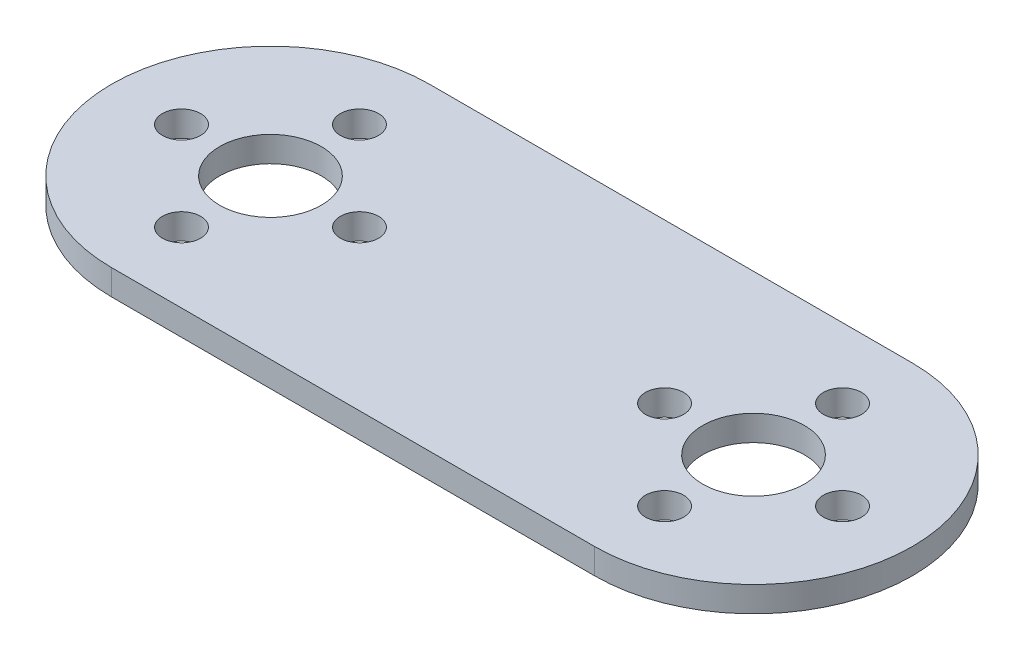
ISO-10303-21;
HEADER;
FILE_DESCRIPTION(('STEP AP214'),'2;1');
FILE_NAME('part.step','',(''),(''),'','','');
FILE_SCHEMA(('AUTOMOTIVE_DESIGN { 1 0 10303 214 1 1 1 1 }'));
ENDSEC;
DATA;
#1=APPLICATION_CONTEXT('core data for automotive mechanical design processes');
#2=APPLICATION_PROTOCOL_DEFINITION('international standard','automotive_design',2000,#1);
#3=PRODUCT_CONTEXT('',#1,'mechanical');
#4=PRODUCT('Part','Part','',(#3));
#5=PRODUCT_RELATED_PRODUCT_CATEGORY('part','',(#4));
#6=PRODUCT_DEFINITION_FORMATION('','',#4);
#7=PRODUCT_DEFINITION_CONTEXT('part definition',#1,'design');
#8=PRODUCT_DEFINITION('design','',#6,#7);
#9=PRODUCT_DEFINITION_SHAPE('','',#8);
#10=(LENGTH_UNIT() NAMED_UNIT(*) SI_UNIT(.MILLI.,.METRE.));
#11=(NAMED_UNIT(*) PLANE_ANGLE_UNIT() SI_UNIT($,.RADIAN.));
#12=(NAMED_UNIT(*) SI_UNIT($,.STERADIAN.) SOLID_ANGLE_UNIT());
#13=UNCERTAINTY_MEASURE_WITH_UNIT(LENGTH_MEASURE(1.E-05),#10,'distance_accuracy_value','');
#14=(GEOMETRIC_REPRESENTATION_CONTEXT(3) GLOBAL_UNCERTAINTY_ASSIGNED_CONTEXT((#13)) GLOBAL_UNIT_ASSIGNED_CONTEXT((#10,
#11,#12)) REPRESENTATION_CONTEXT('',''));
#15=CARTESIAN_POINT('',(0.,0.,0.));
#16=DIRECTION('',(0.,0.,1.));
#17=DIRECTION('',(1.,0.,0.));
#18=AXIS2_PLACEMENT_3D('',#15,#16,#17);
#19=CARTESIAN_POINT('',(-19.,2.,0.));
#20=DIRECTION('',(0.,1.,0.));
#21=DIRECTION('',(0.,0.,1.));
#22=AXIS2_PLACEMENT_3D('',#19,#20,#21);
#23=PLANE('',#22);
#24=CARTESIAN_POINT('',(26.,2.,0.));
#25=DIRECTION('',(0.,1.,0.));
#26=DIRECTION('',(0.,0.,1.));
#27=AXIS2_PLACEMENT_3D('',#24,#25,#26);
#28=CIRCLE('',#27,1.5);
#29=CARTESIAN_POINT('',(26.,2.,1.5));
#30=VERTEX_POINT('',#29);
#31=EDGE_CURVE('E157',#30,#30,#28,.T.);
#32=ORIENTED_EDGE('',*,*,#31,.F.);
#33=EDGE_LOOP('',(#32));
#34=FACE_BOUND('',#33,.T.);
#35=CARTESIAN_POINT('',(12.,2.,0.));
#36=DIRECTION('',(0.,1.,0.));
#37=DIRECTION('',(0.,0.,1.));
#38=AXIS2_PLACEMENT_3D('',#35,#36,#37);
#39=CIRCLE('',#38,1.5);
#40=CARTESIAN_POINT('',(12.,2.,1.5));
#41=VERTEX_POINT('',#40);
#42=EDGE_CURVE('E145',#41,#41,#39,.T.);
#43=ORIENTED_EDGE('',*,*,#42,.F.);
#44=EDGE_LOOP('',(#43));
#45=FACE_BOUND('',#44,.T.);
#46=CARTESIAN_POINT('',(-26.,2.,0.));
#47=DIRECTION('',(0.,1.,0.));
#48=DIRECTION('',(0.,0.,1.));
#49=AXIS2_PLACEMENT_3D('',#46,#47,#48);
#50=CIRCLE('',#49,1.5);
#51=CARTESIAN_POINT('',(-26.,2.,1.5));
#52=VERTEX_POINT('',#51);
#53=EDGE_CURVE('E133',#52,#52,#50,.T.);
#54=ORIENTED_EDGE('',*,*,#53,.F.);
#55=EDGE_LOOP('',(#54));
#56=FACE_BOUND('',#55,.T.);
#57=CARTESIAN_POINT('',(-19.,2.,-7.));
#58=DIRECTION('',(0.,1.,0.));
#59=DIRECTION('',(0.,0.,1.));
#60=AXIS2_PLACEMENT_3D('',#57,#58,#59);
#61=CIRCLE('',#60,1.5);
#62=CARTESIAN_POINT('',(-19.,2.,-5.5));
#63=VERTEX_POINT('',#62);
#64=EDGE_CURVE('E121',#63,#63,#61,.T.);
#65=ORIENTED_EDGE('',*,*,#64,.F.);
#66=EDGE_LOOP('',(#65));
#67=FACE_BOUND('',#66,.T.);
#68=CARTESIAN_POINT('',(-19.,2.,0.));
#69=DIRECTION('',(0.,1.,0.));
#70=DIRECTION('',(0.,0.,1.));
#71=AXIS2_PLACEMENT_3D('',#68,#69,#70);
#72=CIRCLE('',#71,4.);
#73=CARTESIAN_POINT('',(-19.,2.,4.));
#74=VERTEX_POINT('',#73);
#75=EDGE_CURVE('E100',#74,#74,#72,.T.);
#76=ORIENTED_EDGE('',*,*,#75,.F.);
#77=EDGE_LOOP('',(#76));
#78=FACE_BOUND('',#77,.T.);
#79=CARTESIAN_POINT('',(-19.,2.,0.));
#80=DIRECTION('',(0.,1.,0.));
#81=DIRECTION('',(0.,0.,1.));
#82=AXIS2_PLACEMENT_3D('',#79,#80,#81);
#83=CIRCLE('',#82,12.5);
#84=CARTESIAN_POINT('',(-19.,2.,-12.5));
#85=VERTEX_POINT('',#84);
#86=CARTESIAN_POINT('',(-19.,2.,12.5));
#87=VERTEX_POINT('',#86);
#88=EDGE_CURVE('E85',#85,#87,#83,.T.);
#89=ORIENTED_EDGE('',*,*,#88,.T.);
#90=DIRECTION('',(1.,0.,0.));
#91=VECTOR('',#90,1.);
#92=CARTESIAN_POINT('',(19.,2.,12.5));
#93=LINE('',#92,#91);
#94=CARTESIAN_POINT('',(19.,2.,12.5));
#95=VERTEX_POINT('',#94);
#96=EDGE_CURVE('E80',#87,#95,#93,.T.);
#97=ORIENTED_EDGE('',*,*,#96,.T.);
#98=CARTESIAN_POINT('',(19.,2.,0.));
#99=DIRECTION('',(0.,1.,0.));
#100=DIRECTION('',(0.,0.,-1.));
#101=AXIS2_PLACEMENT_3D('',#98,#99,#100);
#102=CIRCLE('',#101,12.5);
#103=CARTESIAN_POINT('',(19.,2.,-12.5));
#104=VERTEX_POINT('',#103);
#105=EDGE_CURVE('E83',#95,#104,#102,.T.);
#106=ORIENTED_EDGE('',*,*,#105,.T.);
#107=DIRECTION('',(-1.,0.,0.));
#108=VECTOR('',#107,1.);
#109=CARTESIAN_POINT('',(19.,2.,-12.5));
#110=LINE('',#109,#108);
#111=EDGE_CURVE('E50',#104,#85,#110,.T.);
#112=ORIENTED_EDGE('',*,*,#111,.T.);
#113=EDGE_LOOP('',(#89,#97,#106,#112));
#114=FACE_BOUND('',#113,.T.);
#115=CARTESIAN_POINT('',(19.,2.,0.));
#116=DIRECTION('',(0.,1.,0.));
#117=DIRECTION('',(0.,0.,1.));
#118=AXIS2_PLACEMENT_3D('',#115,#116,#117);
#119=CIRCLE('',#118,4.);
#120=CARTESIAN_POINT('',(19.,2.,4.));
#121=VERTEX_POINT('',#120);
#122=EDGE_CURVE('E115',#121,#121,#119,.T.);
#123=ORIENTED_EDGE('',*,*,#122,.F.);
#124=EDGE_LOOP('',(#123));
#125=FACE_BOUND('',#124,.T.);
#126=CARTESIAN_POINT('',(-12.,2.,0.));
#127=DIRECTION('',(0.,1.,0.));
#128=DIRECTION('',(0.,0.,1.));
#129=AXIS2_PLACEMENT_3D('',#126,#127,#128);
#130=CIRCLE('',#129,1.5);
#131=CARTESIAN_POINT('',(-12.,2.,1.5));
#132=VERTEX_POINT('',#131);
#133=EDGE_CURVE('E127',#132,#132,#130,.T.);
#134=ORIENTED_EDGE('',*,*,#133,.F.);
#135=EDGE_LOOP('',(#134));
#136=FACE_BOUND('',#135,.T.);
#137=CARTESIAN_POINT('',(-19.,2.,7.));
#138=DIRECTION('',(0.,1.,0.));
#139=DIRECTION('',(0.,0.,1.));
#140=AXIS2_PLACEMENT_3D('',#137,#138,#139);
#141=CIRCLE('',#140,1.5);
#142=CARTESIAN_POINT('',(-19.,2.,8.5));
#143=VERTEX_POINT('',#142);
#144=EDGE_CURVE('E139',#143,#143,#141,.T.);
#145=ORIENTED_EDGE('',*,*,#144,.F.);
#146=EDGE_LOOP('',(#145));
#147=FACE_BOUND('',#146,.T.);
#148=CARTESIAN_POINT('',(19.,2.,-7.));
#149=DIRECTION('',(0.,1.,0.));
#150=DIRECTION('',(0.,0.,1.));
#151=AXIS2_PLACEMENT_3D('',#148,#149,#150);
#152=CIRCLE('',#151,1.5);
#153=CARTESIAN_POINT('',(19.,2.,-5.5));
#154=VERTEX_POINT('',#153);
#155=EDGE_CURVE('E151',#154,#154,#152,.T.);
#156=ORIENTED_EDGE('',*,*,#155,.F.);
#157=EDGE_LOOP('',(#156));
#158=FACE_BOUND('',#157,.T.);
#159=CARTESIAN_POINT('',(19.,2.,7.));
#160=DIRECTION('',(0.,1.,0.));
#161=DIRECTION('',(0.,0.,1.));
#162=AXIS2_PLACEMENT_3D('',#159,#160,#161);
#163=CIRCLE('',#162,1.5);
#164=CARTESIAN_POINT('',(19.,2.,8.5));
#165=VERTEX_POINT('',#164);
#166=EDGE_CURVE('E163',#165,#165,#163,.T.);
#167=ORIENTED_EDGE('',*,*,#166,.F.);
#168=EDGE_LOOP('',(#167));
#169=FACE_BOUND('',#168,.T.);
#170=ADVANCED_FACE('F33',(#34,#45,#56,#67,#78,#114,#125,#136,#147,#158,#169),#23,.T.);
#171=CARTESIAN_POINT('',(-19.,0.,0.));
#172=DIRECTION('',(0.,1.,0.));
#173=DIRECTION('',(0.,0.,1.));
#174=AXIS2_PLACEMENT_3D('',#171,#172,#173);
#175=PLANE('',#174);
#176=CARTESIAN_POINT('',(26.,0.,0.));
#177=DIRECTION('',(0.,1.,0.));
#178=DIRECTION('',(0.,0.,1.));
#179=AXIS2_PLACEMENT_3D('',#176,#177,#178);
#180=CIRCLE('',#179,1.5);
#181=CARTESIAN_POINT('',(26.,0.,1.5));
#182=VERTEX_POINT('',#181);
#183=EDGE_CURVE('E160',#182,#182,#180,.T.);
#184=ORIENTED_EDGE('',*,*,#183,.T.);
#185=EDGE_LOOP('',(#184));
#186=FACE_BOUND('',#185,.T.);
#187=CARTESIAN_POINT('',(12.,0.,0.));
#188=DIRECTION('',(0.,1.,0.));
#189=DIRECTION('',(0.,0.,1.));
#190=AXIS2_PLACEMENT_3D('',#187,#188,#189);
#191=CIRCLE('',#190,1.5);
#192=CARTESIAN_POINT('',(12.,0.,1.5));
#193=VERTEX_POINT('',#192);
#194=EDGE_CURVE('E148',#193,#193,#191,.T.);
#195=ORIENTED_EDGE('',*,*,#194,.T.);
#196=EDGE_LOOP('',(#195));
#197=FACE_BOUND('',#196,.T.);
#198=CARTESIAN_POINT('',(-26.,0.,0.));
#199=DIRECTION('',(0.,1.,0.));
#200=DIRECTION('',(0.,0.,1.));
#201=AXIS2_PLACEMENT_3D('',#198,#199,#200);
#202=CIRCLE('',#201,1.5);
#203=CARTESIAN_POINT('',(-26.,0.,1.5));
#204=VERTEX_POINT('',#203);
#205=EDGE_CURVE('E136',#204,#204,#202,.T.);
#206=ORIENTED_EDGE('',*,*,#205,.T.);
#207=EDGE_LOOP('',(#206));
#208=FACE_BOUND('',#207,.T.);
#209=CARTESIAN_POINT('',(-19.,0.,-7.));
#210=DIRECTION('',(0.,1.,0.));
#211=DIRECTION('',(0.,0.,1.));
#212=AXIS2_PLACEMENT_3D('',#209,#210,#211);
#213=CIRCLE('',#212,1.5);
#214=CARTESIAN_POINT('',(-19.,0.,-5.5));
#215=VERTEX_POINT('',#214);
#216=EDGE_CURVE('E124',#215,#215,#213,.T.);
#217=ORIENTED_EDGE('',*,*,#216,.T.);
#218=EDGE_LOOP('',(#217));
#219=FACE_BOUND('',#218,.T.);
#220=CARTESIAN_POINT('',(-19.,0.,0.));
#221=DIRECTION('',(0.,1.,0.));
#222=DIRECTION('',(0.,0.,1.));
#223=AXIS2_PLACEMENT_3D('',#220,#221,#222);
#224=CIRCLE('',#223,4.);
#225=CARTESIAN_POINT('',(-19.,0.,4.));
#226=VERTEX_POINT('',#225);
#227=EDGE_CURVE('E112',#226,#226,#224,.T.);
#228=ORIENTED_EDGE('',*,*,#227,.T.);
#229=EDGE_LOOP('',(#228));
#230=FACE_BOUND('',#229,.T.);
#231=CARTESIAN_POINT('',(-19.,0.,0.));
#232=DIRECTION('',(0.,1.,0.));
#233=DIRECTION('',(0.,0.,1.));
#234=AXIS2_PLACEMENT_3D('',#231,#232,#233);
#235=CIRCLE('',#234,12.5);
#236=CARTESIAN_POINT('',(-19.,0.,-12.5));
#237=VERTEX_POINT('',#236);
#238=CARTESIAN_POINT('',(-19.,0.,12.5));
#239=VERTEX_POINT('',#238);
#240=EDGE_CURVE('E97',#237,#239,#235,.T.);
#241=ORIENTED_EDGE('',*,*,#240,.F.);
#242=DIRECTION('',(-1.,0.,0.));
#243=VECTOR('',#242,1.);
#244=CARTESIAN_POINT('',(19.,0.,-12.5));
#245=LINE('',#244,#243);
#246=CARTESIAN_POINT('',(19.,0.,-12.5));
#247=VERTEX_POINT('',#246);
#248=EDGE_CURVE('E73',#247,#237,#245,.T.);
#249=ORIENTED_EDGE('',*,*,#248,.F.);
#250=CARTESIAN_POINT('',(19.,0.,0.));
#251=DIRECTION('',(0.,1.,0.));
#252=DIRECTION('',(0.,0.,-1.));
#253=AXIS2_PLACEMENT_3D('',#250,#251,#252);
#254=CIRCLE('',#253,12.5);
#255=CARTESIAN_POINT('',(19.,0.,12.5));
#256=VERTEX_POINT('',#255);
#257=EDGE_CURVE('E67',#256,#247,#254,.T.);
#258=ORIENTED_EDGE('',*,*,#257,.F.);
#259=DIRECTION('',(1.,0.,0.));
#260=VECTOR('',#259,1.);
#261=CARTESIAN_POINT('',(19.,0.,12.5));
#262=LINE('',#261,#260);
#263=EDGE_CURVE('E89',#239,#256,#262,.T.);
#264=ORIENTED_EDGE('',*,*,#263,.F.);
#265=EDGE_LOOP('',(#241,#249,#258,#264));
#266=FACE_BOUND('',#265,.T.);
#267=CARTESIAN_POINT('',(19.,0.,0.));
#268=DIRECTION('',(0.,1.,0.));
#269=DIRECTION('',(0.,0.,1.));
#270=AXIS2_PLACEMENT_3D('',#267,#268,#269);
#271=CIRCLE('',#270,4.);
#272=CARTESIAN_POINT('',(19.,0.,4.));
#273=VERTEX_POINT('',#272);
#274=EDGE_CURVE('E118',#273,#273,#271,.T.);
#275=ORIENTED_EDGE('',*,*,#274,.T.);
#276=EDGE_LOOP('',(#275));
#277=FACE_BOUND('',#276,.T.);
#278=CARTESIAN_POINT('',(-12.,0.,0.));
#279=DIRECTION('',(0.,1.,0.));
#280=DIRECTION('',(0.,0.,1.));
#281=AXIS2_PLACEMENT_3D('',#278,#279,#280);
#282=CIRCLE('',#281,1.5);
#283=CARTESIAN_POINT('',(-12.,0.,1.5));
#284=VERTEX_POINT('',#283);
#285=EDGE_CURVE('E130',#284,#284,#282,.T.);
#286=ORIENTED_EDGE('',*,*,#285,.T.);
#287=EDGE_LOOP('',(#286));
#288=FACE_BOUND('',#287,.T.);
#289=CARTESIAN_POINT('',(-19.,0.,7.));
#290=DIRECTION('',(0.,1.,0.));
#291=DIRECTION('',(0.,0.,1.));
#292=AXIS2_PLACEMENT_3D('',#289,#290,#291);
#293=CIRCLE('',#292,1.5);
#294=CARTESIAN_POINT('',(-19.,0.,8.5));
#295=VERTEX_POINT('',#294);
#296=EDGE_CURVE('E142',#295,#295,#293,.T.);
#297=ORIENTED_EDGE('',*,*,#296,.T.);
#298=EDGE_LOOP('',(#297));
#299=FACE_BOUND('',#298,.T.);
#300=CARTESIAN_POINT('',(19.,0.,-7.));
#301=DIRECTION('',(0.,1.,0.));
#302=DIRECTION('',(0.,0.,1.));
#303=AXIS2_PLACEMENT_3D('',#300,#301,#302);
#304=CIRCLE('',#303,1.5);
#305=CARTESIAN_POINT('',(19.,0.,-5.5));
#306=VERTEX_POINT('',#305);
#307=EDGE_CURVE('E154',#306,#306,#304,.T.);
#308=ORIENTED_EDGE('',*,*,#307,.T.);
#309=EDGE_LOOP('',(#308));
#310=FACE_BOUND('',#309,.T.);
#311=CARTESIAN_POINT('',(19.,0.,7.));
#312=DIRECTION('',(0.,1.,0.));
#313=DIRECTION('',(0.,0.,1.));
#314=AXIS2_PLACEMENT_3D('',#311,#312,#313);
#315=CIRCLE('',#314,1.5);
#316=CARTESIAN_POINT('',(19.,0.,8.5));
#317=VERTEX_POINT('',#316);
#318=EDGE_CURVE('E166',#317,#317,#315,.T.);
#319=ORIENTED_EDGE('',*,*,#318,.T.);
#320=EDGE_LOOP('',(#319));
#321=FACE_BOUND('',#320,.T.);
#322=ADVANCED_FACE('F108',(#186,#197,#208,#219,#230,#266,#277,#288,#299,#310,#321),#175,.F.);
#323=CARTESIAN_POINT('',(-19.,2.,0.));
#324=DIRECTION('',(0.,-1.,0.));
#325=DIRECTION('',(0.,0.,-1.));
#326=AXIS2_PLACEMENT_3D('',#323,#324,#325);
#327=CYLINDRICAL_SURFACE('',#326,12.5);
#328=ORIENTED_EDGE('',*,*,#240,.T.);
#329=DIRECTION('',(0.,-1.,0.));
#330=VECTOR('',#329,1.);
#331=CARTESIAN_POINT('',(-19.,2.,12.5));
#332=LINE('',#331,#330);
#333=EDGE_CURVE('E11',#87,#239,#332,.T.);
#334=ORIENTED_EDGE('',*,*,#333,.F.);
#335=ORIENTED_EDGE('',*,*,#88,.F.);
#336=DIRECTION('',(0.,-1.,0.));
#337=VECTOR('',#336,1.);
#338=CARTESIAN_POINT('',(-19.,2.,-12.5));
#339=LINE('',#338,#337);
#340=EDGE_CURVE('E93',#85,#237,#339,.T.);
#341=ORIENTED_EDGE('',*,*,#340,.T.);
#342=EDGE_LOOP('',(#328,#334,#335,#341));
#343=FACE_BOUND('',#342,.T.);
#344=ADVANCED_FACE('F35',(#343),#327,.T.);
#345=CARTESIAN_POINT('',(19.,2.,12.5));
#346=DIRECTION('',(0.,0.,-1.));
#347=DIRECTION('',(-1.,0.,0.));
#348=AXIS2_PLACEMENT_3D('',#345,#346,#347);
#349=PLANE('',#348);
#350=ORIENTED_EDGE('',*,*,#263,.T.);
#351=DIRECTION('',(0.,-1.,0.));
#352=VECTOR('',#351,1.);
#353=CARTESIAN_POINT('',(19.,2.,12.5));
#354=LINE('',#353,#352);
#355=EDGE_CURVE('E42',#95,#256,#354,.T.);
#356=ORIENTED_EDGE('',*,*,#355,.F.);
#357=ORIENTED_EDGE('',*,*,#96,.F.);
#358=ORIENTED_EDGE('',*,*,#333,.T.);
#359=EDGE_LOOP('',(#350,#356,#357,#358));
#360=FACE_BOUND('',#359,.T.);
#361=ADVANCED_FACE('F88',(#360),#349,.F.);
#362=CARTESIAN_POINT('',(19.,2.,0.));
#363=DIRECTION('',(0.,-1.,0.));
#364=DIRECTION('',(0.,0.,-1.));
#365=AXIS2_PLACEMENT_3D('',#362,#363,#364);
#366=CYLINDRICAL_SURFACE('',#365,12.5);
#367=ORIENTED_EDGE('',*,*,#257,.T.);
#368=DIRECTION('',(0.,-1.,0.));
#369=VECTOR('',#368,1.);
#370=CARTESIAN_POINT('',(19.,2.,-12.5));
#371=LINE('',#370,#369);
#372=EDGE_CURVE('E90',#104,#247,#371,.T.);
#373=ORIENTED_EDGE('',*,*,#372,.F.);
#374=ORIENTED_EDGE('',*,*,#105,.F.);
#375=ORIENTED_EDGE('',*,*,#355,.T.);
#376=EDGE_LOOP('',(#367,#373,#374,#375));
#377=FACE_BOUND('',#376,.T.);
#378=ADVANCED_FACE('F91',(#377),#366,.T.);
#379=CARTESIAN_POINT('',(19.,2.,-12.5));
#380=DIRECTION('',(0.,0.,1.));
#381=DIRECTION('',(1.,0.,0.));
#382=AXIS2_PLACEMENT_3D('',#379,#380,#381);
#383=PLANE('',#382);
#384=ORIENTED_EDGE('',*,*,#248,.T.);
#385=ORIENTED_EDGE('',*,*,#340,.F.);
#386=ORIENTED_EDGE('',*,*,#111,.F.);
#387=ORIENTED_EDGE('',*,*,#372,.T.);
#388=EDGE_LOOP('',(#384,#385,#386,#387));
#389=FACE_BOUND('',#388,.T.);
#390=ADVANCED_FACE('F105',(#389),#383,.F.);
#391=CARTESIAN_POINT('',(-19.,2.,0.));
#392=DIRECTION('',(0.,-1.,0.));
#393=DIRECTION('',(0.,0.,-1.));
#394=AXIS2_PLACEMENT_3D('',#391,#392,#393);
#395=CYLINDRICAL_SURFACE('',#394,4.);
#396=ORIENTED_EDGE('',*,*,#75,.T.);
#397=EDGE_LOOP('',(#396));
#398=FACE_BOUND('',#397,.T.);
#399=ORIENTED_EDGE('',*,*,#227,.F.);
#400=EDGE_LOOP('',(#399));
#401=FACE_BOUND('',#400,.T.);
#402=ADVANCED_FACE('F186',(#398,#401),#395,.F.);
#403=CARTESIAN_POINT('',(19.,2.,0.));
#404=DIRECTION('',(0.,-1.,0.));
#405=DIRECTION('',(0.,0.,-1.));
#406=AXIS2_PLACEMENT_3D('',#403,#404,#405);
#407=CYLINDRICAL_SURFACE('',#406,4.);
#408=ORIENTED_EDGE('',*,*,#122,.T.);
#409=EDGE_LOOP('',(#408));
#410=FACE_BOUND('',#409,.T.);
#411=ORIENTED_EDGE('',*,*,#274,.F.);
#412=EDGE_LOOP('',(#411));
#413=FACE_BOUND('',#412,.T.);
#414=ADVANCED_FACE('F232',(#410,#413),#407,.F.);
#415=CARTESIAN_POINT('',(-19.,2.,-7.));
#416=DIRECTION('',(0.,-1.,0.));
#417=DIRECTION('',(0.,0.,-1.));
#418=AXIS2_PLACEMENT_3D('',#415,#416,#417);
#419=CYLINDRICAL_SURFACE('',#418,1.5);
#420=ORIENTED_EDGE('',*,*,#64,.T.);
#421=EDGE_LOOP('',(#420));
#422=FACE_BOUND('',#421,.T.);
#423=ORIENTED_EDGE('',*,*,#216,.F.);
#424=EDGE_LOOP('',(#423));
#425=FACE_BOUND('',#424,.T.);
#426=ADVANCED_FACE('F240',(#422,#425),#419,.F.);
#427=CARTESIAN_POINT('',(-12.,2.,0.));
#428=DIRECTION('',(0.,-1.,0.));
#429=DIRECTION('',(0.,0.,-1.));
#430=AXIS2_PLACEMENT_3D('',#427,#428,#429);
#431=CYLINDRICAL_SURFACE('',#430,1.5);
#432=ORIENTED_EDGE('',*,*,#133,.T.);
#433=EDGE_LOOP('',(#432));
#434=FACE_BOUND('',#433,.T.);
#435=ORIENTED_EDGE('',*,*,#285,.F.);
#436=EDGE_LOOP('',(#435));
#437=FACE_BOUND('',#436,.T.);
#438=ADVANCED_FACE('F248',(#434,#437),#431,.F.);
#439=CARTESIAN_POINT('',(-26.,2.,0.));
#440=DIRECTION('',(0.,-1.,0.));
#441=DIRECTION('',(0.,0.,-1.));
#442=AXIS2_PLACEMENT_3D('',#439,#440,#441);
#443=CYLINDRICAL_SURFACE('',#442,1.5);
#444=ORIENTED_EDGE('',*,*,#53,.T.);
#445=EDGE_LOOP('',(#444));
#446=FACE_BOUND('',#445,.T.);
#447=ORIENTED_EDGE('',*,*,#205,.F.);
#448=EDGE_LOOP('',(#447));
#449=FACE_BOUND('',#448,.T.);
#450=ADVANCED_FACE('F257',(#446,#449),#443,.F.);
#451=CARTESIAN_POINT('',(-19.,2.,7.));
#452=DIRECTION('',(0.,-1.,0.));
#453=DIRECTION('',(0.,0.,-1.));
#454=AXIS2_PLACEMENT_3D('',#451,#452,#453);
#455=CYLINDRICAL_SURFACE('',#454,1.5);
#456=ORIENTED_EDGE('',*,*,#144,.T.);
#457=EDGE_LOOP('',(#456));
#458=FACE_BOUND('',#457,.T.);
#459=ORIENTED_EDGE('',*,*,#296,.F.);
#460=EDGE_LOOP('',(#459));
#461=FACE_BOUND('',#460,.T.);
#462=ADVANCED_FACE('F266',(#458,#461),#455,.F.);
#463=CARTESIAN_POINT('',(12.,2.,0.));
#464=DIRECTION('',(0.,-1.,0.));
#465=DIRECTION('',(0.,0.,-1.));
#466=AXIS2_PLACEMENT_3D('',#463,#464,#465);
#467=CYLINDRICAL_SURFACE('',#466,1.5);
#468=ORIENTED_EDGE('',*,*,#42,.T.);
#469=EDGE_LOOP('',(#468));
#470=FACE_BOUND('',#469,.T.);
#471=ORIENTED_EDGE('',*,*,#194,.F.);
#472=EDGE_LOOP('',(#471));
#473=FACE_BOUND('',#472,.T.);
#474=ADVANCED_FACE('F275',(#470,#473),#467,.F.);
#475=CARTESIAN_POINT('',(19.,2.,-7.));
#476=DIRECTION('',(0.,-1.,0.));
#477=DIRECTION('',(0.,0.,-1.));
#478=AXIS2_PLACEMENT_3D('',#475,#476,#477);
#479=CYLINDRICAL_SURFACE('',#478,1.5);
#480=ORIENTED_EDGE('',*,*,#155,.T.);
#481=EDGE_LOOP('',(#480));
#482=FACE_BOUND('',#481,.T.);
#483=ORIENTED_EDGE('',*,*,#307,.F.);
#484=EDGE_LOOP('',(#483));
#485=FACE_BOUND('',#484,.T.);
#486=ADVANCED_FACE('F284',(#482,#485),#479,.F.);
#487=CARTESIAN_POINT('',(26.,2.,0.));
#488=DIRECTION('',(0.,-1.,0.));
#489=DIRECTION('',(0.,0.,-1.));
#490=AXIS2_PLACEMENT_3D('',#487,#488,#489);
#491=CYLINDRICAL_SURFACE('',#490,1.5);
#492=ORIENTED_EDGE('',*,*,#31,.T.);
#493=EDGE_LOOP('',(#492));
#494=FACE_BOUND('',#493,.T.);
#495=ORIENTED_EDGE('',*,*,#183,.F.);
#496=EDGE_LOOP('',(#495));
#497=FACE_BOUND('',#496,.T.);
#498=ADVANCED_FACE('F293',(#494,#497),#491,.F.);
#499=CARTESIAN_POINT('',(19.,2.,7.));
#500=DIRECTION('',(0.,-1.,0.));
#501=DIRECTION('',(0.,0.,-1.));
#502=AXIS2_PLACEMENT_3D('',#499,#500,#501);
#503=CYLINDRICAL_SURFACE('',#502,1.5);
#504=ORIENTED_EDGE('',*,*,#166,.T.);
#505=EDGE_LOOP('',(#504));
#506=FACE_BOUND('',#505,.T.);
#507=ORIENTED_EDGE('',*,*,#318,.F.);
#508=EDGE_LOOP('',(#507));
#509=FACE_BOUND('',#508,.T.);
#510=ADVANCED_FACE('F172',(#506,#509),#503,.F.);
#511=CLOSED_SHELL('',(#170,#322,#344,#361,#378,#390,#402,#414,#426,#438,#450,#462,#474,#486,
#498,#510));
#512=MANIFOLD_SOLID_BREP('B2',#511);
#513=ADVANCED_BREP_SHAPE_REPRESENTATION('',(#18,#512),#14);
#514=SHAPE_DEFINITION_REPRESENTATION(#9,#513);
ENDSEC;
END-ISO-10303-21;
